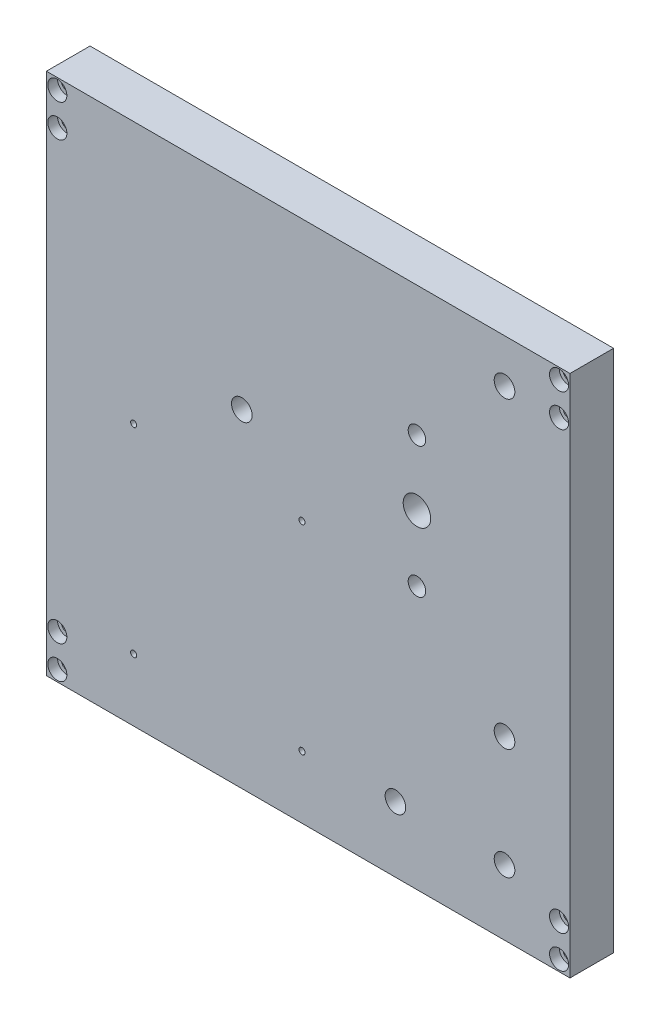
ISO-10303-21;
HEADER;
FILE_DESCRIPTION(('STEP AP214'),'2;1');
FILE_NAME('part.step','',(''),(''),'','','');
FILE_SCHEMA(('AUTOMOTIVE_DESIGN { 1 0 10303 214 1 1 1 1 }'));
ENDSEC;
DATA;
#1=APPLICATION_CONTEXT('core data for automotive mechanical design processes');
#2=APPLICATION_PROTOCOL_DEFINITION('international standard','automotive_design',2000,#1);
#3=PRODUCT_CONTEXT('',#1,'mechanical');
#4=PRODUCT('Part','Part','',(#3));
#5=PRODUCT_RELATED_PRODUCT_CATEGORY('part','',(#4));
#6=PRODUCT_DEFINITION_FORMATION('','',#4);
#7=PRODUCT_DEFINITION_CONTEXT('part definition',#1,'design');
#8=PRODUCT_DEFINITION('design','',#6,#7);
#9=PRODUCT_DEFINITION_SHAPE('','',#8);
#10=(LENGTH_UNIT() NAMED_UNIT(*) SI_UNIT(.MILLI.,.METRE.));
#11=(NAMED_UNIT(*) PLANE_ANGLE_UNIT() SI_UNIT($,.RADIAN.));
#12=(NAMED_UNIT(*) SI_UNIT($,.STERADIAN.) SOLID_ANGLE_UNIT());
#13=UNCERTAINTY_MEASURE_WITH_UNIT(LENGTH_MEASURE(1.E-05),#10,'distance_accuracy_value','');
#14=(GEOMETRIC_REPRESENTATION_CONTEXT(3) GLOBAL_UNCERTAINTY_ASSIGNED_CONTEXT((#13)) GLOBAL_UNIT_ASSIGNED_CONTEXT((#10,
#11,#12)) REPRESENTATION_CONTEXT('',''));
#15=CARTESIAN_POINT('',(0.,0.,0.));
#16=DIRECTION('',(0.,0.,1.));
#17=DIRECTION('',(1.,0.,0.));
#18=AXIS2_PLACEMENT_3D('',#15,#16,#17);
#19=CARTESIAN_POINT('',(-76.2,-76.2,12.7));
#20=DIRECTION('',(-1.,0.,0.));
#21=DIRECTION('',(0.,0.,1.));
#22=AXIS2_PLACEMENT_3D('',#19,#20,#21);
#23=PLANE('',#22);
#24=DIRECTION('',(0.,1.,0.));
#25=VECTOR('',#24,1.);
#26=CARTESIAN_POINT('',(-76.2,-76.2,0.));
#27=LINE('',#26,#25);
#28=CARTESIAN_POINT('',(-76.2,-76.2,0.));
#29=VERTEX_POINT('',#28);
#30=CARTESIAN_POINT('',(-76.2,76.2,0.));
#31=VERTEX_POINT('',#30);
#32=EDGE_CURVE('E114',#29,#31,#27,.T.);
#33=ORIENTED_EDGE('',*,*,#32,.F.);
#34=DIRECTION('',(0.,0.,-1.));
#35=VECTOR('',#34,1.);
#36=CARTESIAN_POINT('',(-76.2,-76.2,12.7));
#37=LINE('',#36,#35);
#38=CARTESIAN_POINT('',(-76.2,-76.2,12.7));
#39=VERTEX_POINT('',#38);
#40=EDGE_CURVE('E13',#39,#29,#37,.T.);
#41=ORIENTED_EDGE('',*,*,#40,.F.);
#42=DIRECTION('',(0.,1.,0.));
#43=VECTOR('',#42,1.);
#44=CARTESIAN_POINT('',(-76.2,-76.2,12.7));
#45=LINE('',#44,#43);
#46=CARTESIAN_POINT('',(-76.2,76.2,12.7));
#47=VERTEX_POINT('',#46);
#48=EDGE_CURVE('E108',#39,#47,#45,.T.);
#49=ORIENTED_EDGE('',*,*,#48,.T.);
#50=DIRECTION('',(0.,0.,-1.));
#51=VECTOR('',#50,1.);
#52=CARTESIAN_POINT('',(-76.2,76.2,12.7));
#53=LINE('',#52,#51);
#54=EDGE_CURVE('E51',#47,#31,#53,.T.);
#55=ORIENTED_EDGE('',*,*,#54,.T.);
#56=EDGE_LOOP('',(#33,#41,#49,#55));
#57=FACE_BOUND('',#56,.T.);
#58=ADVANCED_FACE('F48',(#57),#23,.T.);
#59=CARTESIAN_POINT('',(-76.2,-76.2,12.7));
#60=DIRECTION('',(0.,1.,0.));
#61=DIRECTION('',(0.,0.,1.));
#62=AXIS2_PLACEMENT_3D('',#59,#60,#61);
#63=PLANE('',#62);
#64=DIRECTION('',(1.,0.,0.));
#65=VECTOR('',#64,1.);
#66=CARTESIAN_POINT('',(-76.2,-76.2,0.));
#67=LINE('',#66,#65);
#68=CARTESIAN_POINT('',(76.2,-76.2,0.));
#69=VERTEX_POINT('',#68);
#70=EDGE_CURVE('E81',#29,#69,#67,.T.);
#71=ORIENTED_EDGE('',*,*,#70,.T.);
#72=DIRECTION('',(0.,0.,-1.));
#73=VECTOR('',#72,1.);
#74=CARTESIAN_POINT('',(76.2,-76.2,12.7));
#75=LINE('',#74,#73);
#76=CARTESIAN_POINT('',(76.2,-76.2,12.7));
#77=VERTEX_POINT('',#76);
#78=EDGE_CURVE('E57',#77,#69,#75,.T.);
#79=ORIENTED_EDGE('',*,*,#78,.F.);
#80=DIRECTION('',(1.,0.,0.));
#81=VECTOR('',#80,1.);
#82=CARTESIAN_POINT('',(-76.2,-76.2,12.7));
#83=LINE('',#82,#81);
#84=EDGE_CURVE('E98',#39,#77,#83,.T.);
#85=ORIENTED_EDGE('',*,*,#84,.F.);
#86=ORIENTED_EDGE('',*,*,#40,.T.);
#87=EDGE_LOOP('',(#71,#79,#85,#86));
#88=FACE_BOUND('',#87,.T.);
#89=ADVANCED_FACE('F125',(#88),#63,.F.);
#90=CARTESIAN_POINT('',(76.2,-76.2,12.7));
#91=DIRECTION('',(-1.,0.,0.));
#92=DIRECTION('',(0.,0.,1.));
#93=AXIS2_PLACEMENT_3D('',#90,#91,#92);
#94=PLANE('',#93);
#95=DIRECTION('',(0.,1.,0.));
#96=VECTOR('',#95,1.);
#97=CARTESIAN_POINT('',(76.2,-76.2,0.));
#98=LINE('',#97,#96);
#99=CARTESIAN_POINT('',(76.2,76.2,0.));
#100=VERTEX_POINT('',#99);
#101=EDGE_CURVE('E105',#69,#100,#98,.T.);
#102=ORIENTED_EDGE('',*,*,#101,.T.);
#103=DIRECTION('',(0.,0.,-1.));
#104=VECTOR('',#103,1.);
#105=CARTESIAN_POINT('',(76.2,76.2,12.7));
#106=LINE('',#105,#104);
#107=CARTESIAN_POINT('',(76.2,76.2,12.7));
#108=VERTEX_POINT('',#107);
#109=EDGE_CURVE('E102',#108,#100,#106,.T.);
#110=ORIENTED_EDGE('',*,*,#109,.F.);
#111=DIRECTION('',(0.,1.,0.));
#112=VECTOR('',#111,1.);
#113=CARTESIAN_POINT('',(76.2,-76.2,12.7));
#114=LINE('',#113,#112);
#115=EDGE_CURVE('E93',#77,#108,#114,.T.);
#116=ORIENTED_EDGE('',*,*,#115,.F.);
#117=ORIENTED_EDGE('',*,*,#78,.T.);
#118=EDGE_LOOP('',(#102,#110,#116,#117));
#119=FACE_BOUND('',#118,.T.);
#120=ADVANCED_FACE('F103',(#119),#94,.F.);
#121=CARTESIAN_POINT('',(-76.2,76.2,12.7));
#122=DIRECTION('',(0.,1.,0.));
#123=DIRECTION('',(0.,0.,1.));
#124=AXIS2_PLACEMENT_3D('',#121,#122,#123);
#125=PLANE('',#124);
#126=DIRECTION('',(1.,0.,0.));
#127=VECTOR('',#126,1.);
#128=CARTESIAN_POINT('',(-76.2,76.2,0.));
#129=LINE('',#128,#127);
#130=EDGE_CURVE('E117',#31,#100,#129,.T.);
#131=ORIENTED_EDGE('',*,*,#130,.F.);
#132=ORIENTED_EDGE('',*,*,#54,.F.);
#133=DIRECTION('',(1.,0.,0.));
#134=VECTOR('',#133,1.);
#135=CARTESIAN_POINT('',(-76.2,76.2,12.7));
#136=LINE('',#135,#134);
#137=EDGE_CURVE('E97',#47,#108,#136,.T.);
#138=ORIENTED_EDGE('',*,*,#137,.T.);
#139=ORIENTED_EDGE('',*,*,#109,.T.);
#140=EDGE_LOOP('',(#131,#132,#138,#139));
#141=FACE_BOUND('',#140,.T.);
#142=ADVANCED_FACE('F107',(#141),#125,.T.);
#143=CARTESIAN_POINT('',(0.,0.,12.7));
#144=DIRECTION('',(0.,0.,-1.));
#145=DIRECTION('',(-1.,0.,0.));
#146=AXIS2_PLACEMENT_3D('',#143,#144,#145);
#147=PLANE('',#146);
#148=CARTESIAN_POINT('',(31.6596969401435,0.299500000000012,12.7));
#149=DIRECTION('',(0.,0.,1.));
#150=DIRECTION('',(1.,0.,0.));
#151=AXIS2_PLACEMENT_3D('',#148,#149,#150);
#152=CIRCLE('',#151,2.5527);
#153=CARTESIAN_POINT('',(34.2123969401435,0.299500000000012,12.7));
#154=VERTEX_POINT('',#153);
#155=EDGE_CURVE('E298',#154,#154,#152,.T.);
#156=ORIENTED_EDGE('',*,*,#155,.F.);
#157=EDGE_LOOP('',(#156));
#158=FACE_BOUND('',#157,.T.);
#159=CARTESIAN_POINT('',(31.6596969401435,38.3995,12.7));
#160=DIRECTION('',(0.,0.,1.));
#161=DIRECTION('',(1.,0.,0.));
#162=AXIS2_PLACEMENT_3D('',#159,#160,#161);
#163=CIRCLE('',#162,2.5527);
#164=CARTESIAN_POINT('',(34.2123969401435,38.3995,12.7));
#165=VERTEX_POINT('',#164);
#166=EDGE_CURVE('E300',#165,#165,#163,.T.);
#167=ORIENTED_EDGE('',*,*,#166,.F.);
#168=EDGE_LOOP('',(#167));
#169=FACE_BOUND('',#168,.T.);
#170=CARTESIAN_POINT('',(31.6596969401435,19.3495,12.7));
#171=DIRECTION('',(0.,0.,1.));
#172=DIRECTION('',(1.,0.,0.));
#173=AXIS2_PLACEMENT_3D('',#170,#171,#172);
#174=CIRCLE('',#173,4.);
#175=CARTESIAN_POINT('',(35.6596969401435,19.3495,12.7));
#176=VERTEX_POINT('',#175);
#177=EDGE_CURVE('E308',#176,#176,#174,.T.);
#178=ORIENTED_EDGE('',*,*,#177,.F.);
#179=EDGE_LOOP('',(#178));
#180=FACE_BOUND('',#179,.T.);
#181=CARTESIAN_POINT('',(57.15,63.5,12.7));
#182=DIRECTION('',(0.,0.,1.));
#183=DIRECTION('',(1.,0.,0.));
#184=AXIS2_PLACEMENT_3D('',#181,#182,#183);
#185=CIRCLE('',#184,2.99999999999999);
#186=CARTESIAN_POINT('',(60.15,63.5,12.7));
#187=VERTEX_POINT('',#186);
#188=EDGE_CURVE('E314',#187,#187,#185,.T.);
#189=ORIENTED_EDGE('',*,*,#188,.F.);
#190=EDGE_LOOP('',(#189));
#191=FACE_BOUND('',#190,.T.);
#192=CARTESIAN_POINT('',(57.15,-24.801,12.7));
#193=DIRECTION('',(0.,0.,1.));
#194=DIRECTION('',(1.,0.,0.));
#195=AXIS2_PLACEMENT_3D('',#192,#193,#194);
#196=CIRCLE('',#195,2.99999999999999);
#197=CARTESIAN_POINT('',(60.15,-24.801,12.7));
#198=VERTEX_POINT('',#197);
#199=EDGE_CURVE('E320',#198,#198,#196,.T.);
#200=ORIENTED_EDGE('',*,*,#199,.F.);
#201=EDGE_LOOP('',(#200));
#202=FACE_BOUND('',#201,.T.);
#203=CARTESIAN_POINT('',(-19.3209091795697,19.3495,12.7));
#204=DIRECTION('',(0.,0.,1.));
#205=DIRECTION('',(1.,0.,0.));
#206=AXIS2_PLACEMENT_3D('',#203,#204,#205);
#207=CIRCLE('',#206,2.99999999999999);
#208=CARTESIAN_POINT('',(-16.3209091795697,19.3495,12.7));
#209=VERTEX_POINT('',#208);
#210=EDGE_CURVE('E326',#209,#209,#207,.T.);
#211=ORIENTED_EDGE('',*,*,#210,.F.);
#212=EDGE_LOOP('',(#211));
#213=FACE_BOUND('',#212,.T.);
#214=CARTESIAN_POINT('',(57.15,-57.15,12.7));
#215=DIRECTION('',(0.,0.,1.));
#216=DIRECTION('',(1.,0.,0.));
#217=AXIS2_PLACEMENT_3D('',#214,#215,#216);
#218=CIRCLE('',#217,2.99999999999999);
#219=CARTESIAN_POINT('',(60.15,-57.15,12.7));
#220=VERTEX_POINT('',#219);
#221=EDGE_CURVE('E332',#220,#220,#218,.T.);
#222=ORIENTED_EDGE('',*,*,#221,.F.);
#223=EDGE_LOOP('',(#222));
#224=FACE_BOUND('',#223,.T.);
#225=CARTESIAN_POINT('',(25.4,-57.15,12.7));
#226=DIRECTION('',(0.,0.,1.));
#227=DIRECTION('',(1.,0.,0.));
#228=AXIS2_PLACEMENT_3D('',#225,#226,#227);
#229=CIRCLE('',#228,2.99999999999999);
#230=CARTESIAN_POINT('',(28.4,-57.15,12.7));
#231=VERTEX_POINT('',#230);
#232=EDGE_CURVE('E338',#231,#231,#229,.T.);
#233=ORIENTED_EDGE('',*,*,#232,.F.);
#234=EDGE_LOOP('',(#233));
#235=FACE_BOUND('',#234,.T.);
#236=CARTESIAN_POINT('',(-73.025,63.5,12.7));
#237=DIRECTION('',(0.,0.,1.));
#238=DIRECTION('',(1.,0.,0.));
#239=AXIS2_PLACEMENT_3D('',#236,#237,#238);
#240=CIRCLE('',#239,2.77876000000001);
#241=CARTESIAN_POINT('',(-70.24624,63.5,12.7));
#242=VERTEX_POINT('',#241);
#243=EDGE_CURVE('E344',#242,#242,#240,.T.);
#244=ORIENTED_EDGE('',*,*,#243,.F.);
#245=EDGE_LOOP('',(#244));
#246=FACE_BOUND('',#245,.T.);
#247=CARTESIAN_POINT('',(-73.025,73.025,12.7));
#248=DIRECTION('',(0.,0.,1.));
#249=DIRECTION('',(1.,0.,0.));
#250=AXIS2_PLACEMENT_3D('',#247,#248,#249);
#251=CIRCLE('',#250,2.77876000000001);
#252=CARTESIAN_POINT('',(-70.24624,73.025,12.7));
#253=VERTEX_POINT('',#252);
#254=EDGE_CURVE('E356',#253,#253,#251,.T.);
#255=ORIENTED_EDGE('',*,*,#254,.F.);
#256=EDGE_LOOP('',(#255));
#257=FACE_BOUND('',#256,.T.);
#258=CARTESIAN_POINT('',(73.025,63.5,12.7));
#259=DIRECTION('',(0.,0.,1.));
#260=DIRECTION('',(1.,0.,0.));
#261=AXIS2_PLACEMENT_3D('',#258,#259,#260);
#262=CIRCLE('',#261,2.77876000000001);
#263=CARTESIAN_POINT('',(75.80376,63.5,12.7));
#264=VERTEX_POINT('',#263);
#265=EDGE_CURVE('E368',#264,#264,#262,.T.);
#266=ORIENTED_EDGE('',*,*,#265,.F.);
#267=EDGE_LOOP('',(#266));
#268=FACE_BOUND('',#267,.T.);
#269=CARTESIAN_POINT('',(73.025,73.025,12.7));
#270=DIRECTION('',(0.,0.,1.));
#271=DIRECTION('',(1.,0.,0.));
#272=AXIS2_PLACEMENT_3D('',#269,#270,#271);
#273=CIRCLE('',#272,2.77876000000001);
#274=CARTESIAN_POINT('',(75.80376,73.025,12.7));
#275=VERTEX_POINT('',#274);
#276=EDGE_CURVE('E380',#275,#275,#273,.T.);
#277=ORIENTED_EDGE('',*,*,#276,.F.);
#278=EDGE_LOOP('',(#277));
#279=FACE_BOUND('',#278,.T.);
#280=CARTESIAN_POINT('',(73.025,-63.5,12.7));
#281=DIRECTION('',(0.,0.,1.));
#282=DIRECTION('',(1.,0.,0.));
#283=AXIS2_PLACEMENT_3D('',#280,#281,#282);
#284=CIRCLE('',#283,2.77876000000001);
#285=CARTESIAN_POINT('',(75.80376,-63.5,12.7));
#286=VERTEX_POINT('',#285);
#287=EDGE_CURVE('E392',#286,#286,#284,.T.);
#288=ORIENTED_EDGE('',*,*,#287,.F.);
#289=EDGE_LOOP('',(#288));
#290=FACE_BOUND('',#289,.T.);
#291=CARTESIAN_POINT('',(73.025,-73.025,12.7));
#292=DIRECTION('',(0.,0.,1.));
#293=DIRECTION('',(1.,0.,0.));
#294=AXIS2_PLACEMENT_3D('',#291,#292,#293);
#295=CIRCLE('',#294,2.77876000000001);
#296=CARTESIAN_POINT('',(75.80376,-73.025,12.7));
#297=VERTEX_POINT('',#296);
#298=EDGE_CURVE('E404',#297,#297,#295,.T.);
#299=ORIENTED_EDGE('',*,*,#298,.F.);
#300=EDGE_LOOP('',(#299));
#301=FACE_BOUND('',#300,.T.);
#302=CARTESIAN_POINT('',(-73.025,-63.5,12.7));
#303=DIRECTION('',(0.,0.,1.));
#304=DIRECTION('',(1.,0.,0.));
#305=AXIS2_PLACEMENT_3D('',#302,#303,#304);
#306=CIRCLE('',#305,2.77876000000001);
#307=CARTESIAN_POINT('',(-70.24624,-63.5,12.7));
#308=VERTEX_POINT('',#307);
#309=EDGE_CURVE('E416',#308,#308,#306,.T.);
#310=ORIENTED_EDGE('',*,*,#309,.F.);
#311=EDGE_LOOP('',(#310));
#312=FACE_BOUND('',#311,.T.);
#313=CARTESIAN_POINT('',(-73.025,-73.025,12.7));
#314=DIRECTION('',(0.,0.,1.));
#315=DIRECTION('',(1.,0.,0.));
#316=AXIS2_PLACEMENT_3D('',#313,#314,#315);
#317=CIRCLE('',#316,2.77876000000001);
#318=CARTESIAN_POINT('',(-70.24624,-73.025,12.7));
#319=VERTEX_POINT('',#318);
#320=EDGE_CURVE('E428',#319,#319,#317,.T.);
#321=ORIENTED_EDGE('',*,*,#320,.F.);
#322=EDGE_LOOP('',(#321));
#323=FACE_BOUND('',#322,.T.);
#324=CARTESIAN_POINT('',(-50.8,0.,12.7));
#325=DIRECTION('',(0.,0.,1.));
#326=DIRECTION('',(1.,0.,0.));
#327=AXIS2_PLACEMENT_3D('',#324,#325,#326);
#328=CIRCLE('',#327,0.888999999999987);
#329=CARTESIAN_POINT('',(-49.911,0.,12.7));
#330=VERTEX_POINT('',#329);
#331=EDGE_CURVE('E440',#330,#330,#328,.T.);
#332=ORIENTED_EDGE('',*,*,#331,.F.);
#333=EDGE_LOOP('',(#332));
#334=FACE_BOUND('',#333,.T.);
#335=CARTESIAN_POINT('',(-50.8,-58.,12.7));
#336=DIRECTION('',(0.,0.,1.));
#337=DIRECTION('',(1.,0.,0.));
#338=AXIS2_PLACEMENT_3D('',#335,#336,#337);
#339=CIRCLE('',#338,0.888999999999987);
#340=CARTESIAN_POINT('',(-49.911,-58.,12.7));
#341=VERTEX_POINT('',#340);
#342=EDGE_CURVE('E446',#341,#341,#339,.T.);
#343=ORIENTED_EDGE('',*,*,#342,.F.);
#344=EDGE_LOOP('',(#343));
#345=FACE_BOUND('',#344,.T.);
#346=CARTESIAN_POINT('',(-1.79999999999998,-58.,12.7));
#347=DIRECTION('',(0.,0.,1.));
#348=DIRECTION('',(1.,0.,0.));
#349=AXIS2_PLACEMENT_3D('',#346,#347,#348);
#350=CIRCLE('',#349,0.888999999999987);
#351=CARTESIAN_POINT('',(-0.910999999999988,-58.,12.7));
#352=VERTEX_POINT('',#351);
#353=EDGE_CURVE('E452',#352,#352,#350,.T.);
#354=ORIENTED_EDGE('',*,*,#353,.F.);
#355=EDGE_LOOP('',(#354));
#356=FACE_BOUND('',#355,.T.);
#357=CARTESIAN_POINT('',(-1.79999999999996,0.,12.7));
#358=DIRECTION('',(0.,0.,1.));
#359=DIRECTION('',(1.,0.,0.));
#360=AXIS2_PLACEMENT_3D('',#357,#358,#359);
#361=CIRCLE('',#360,0.888999999999987);
#362=CARTESIAN_POINT('',(-0.910999999999974,0.,12.7));
#363=VERTEX_POINT('',#362);
#364=EDGE_CURVE('E458',#363,#363,#361,.T.);
#365=ORIENTED_EDGE('',*,*,#364,.F.);
#366=EDGE_LOOP('',(#365));
#367=FACE_BOUND('',#366,.T.);
#368=ORIENTED_EDGE('',*,*,#48,.F.);
#369=ORIENTED_EDGE('',*,*,#84,.T.);
#370=ORIENTED_EDGE('',*,*,#115,.T.);
#371=ORIENTED_EDGE('',*,*,#137,.F.);
#372=EDGE_LOOP('',(#368,#369,#370,#371));
#373=FACE_BOUND('',#372,.T.);
#374=ADVANCED_FACE('F96',(#158,#169,#180,#191,#202,#213,#224,#235,#246,#257,#268,#279,#290,#301,
#312,#323,#334,#345,#356,#367,#373),#147,.F.);
#375=CARTESIAN_POINT('',(0.,0.,0.));
#376=DIRECTION('',(0.,0.,-1.));
#377=DIRECTION('',(-1.,0.,0.));
#378=AXIS2_PLACEMENT_3D('',#375,#376,#377);
#379=PLANE('',#378);
#380=CARTESIAN_POINT('',(31.6596969401435,0.299500000000012,0.));
#381=DIRECTION('',(0.,0.,1.));
#382=DIRECTION('',(1.,0.,0.));
#383=AXIS2_PLACEMENT_3D('',#380,#381,#382);
#384=CIRCLE('',#383,2.5527);
#385=CARTESIAN_POINT('',(34.2123969401435,0.299500000000012,0.));
#386=VERTEX_POINT('',#385);
#387=EDGE_CURVE('E296',#386,#386,#384,.T.);
#388=ORIENTED_EDGE('',*,*,#387,.T.);
#389=EDGE_LOOP('',(#388));
#390=FACE_BOUND('',#389,.T.);
#391=CARTESIAN_POINT('',(31.6596969401435,38.3995,0.));
#392=DIRECTION('',(0.,0.,1.));
#393=DIRECTION('',(1.,0.,0.));
#394=AXIS2_PLACEMENT_3D('',#391,#392,#393);
#395=CIRCLE('',#394,2.5527);
#396=CARTESIAN_POINT('',(34.2123969401435,38.3995,0.));
#397=VERTEX_POINT('',#396);
#398=EDGE_CURVE('E305',#397,#397,#395,.T.);
#399=ORIENTED_EDGE('',*,*,#398,.T.);
#400=EDGE_LOOP('',(#399));
#401=FACE_BOUND('',#400,.T.);
#402=CARTESIAN_POINT('',(31.6596969401435,19.3495,0.));
#403=DIRECTION('',(0.,0.,1.));
#404=DIRECTION('',(1.,0.,0.));
#405=AXIS2_PLACEMENT_3D('',#402,#403,#404);
#406=CIRCLE('',#405,4.);
#407=CARTESIAN_POINT('',(35.6596969401435,19.3495,0.));
#408=VERTEX_POINT('',#407);
#409=EDGE_CURVE('E311',#408,#408,#406,.T.);
#410=ORIENTED_EDGE('',*,*,#409,.T.);
#411=EDGE_LOOP('',(#410));
#412=FACE_BOUND('',#411,.T.);
#413=CARTESIAN_POINT('',(57.15,63.5,0.));
#414=DIRECTION('',(0.,0.,1.));
#415=DIRECTION('',(1.,0.,0.));
#416=AXIS2_PLACEMENT_3D('',#413,#414,#415);
#417=CIRCLE('',#416,3.);
#418=CARTESIAN_POINT('',(60.15,63.5,0.));
#419=VERTEX_POINT('',#418);
#420=EDGE_CURVE('E317',#419,#419,#417,.T.);
#421=ORIENTED_EDGE('',*,*,#420,.T.);
#422=EDGE_LOOP('',(#421));
#423=FACE_BOUND('',#422,.T.);
#424=CARTESIAN_POINT('',(57.15,-24.801,0.));
#425=DIRECTION('',(0.,0.,1.));
#426=DIRECTION('',(1.,0.,0.));
#427=AXIS2_PLACEMENT_3D('',#424,#425,#426);
#428=CIRCLE('',#427,3.);
#429=CARTESIAN_POINT('',(60.15,-24.801,0.));
#430=VERTEX_POINT('',#429);
#431=EDGE_CURVE('E323',#430,#430,#428,.T.);
#432=ORIENTED_EDGE('',*,*,#431,.T.);
#433=EDGE_LOOP('',(#432));
#434=FACE_BOUND('',#433,.T.);
#435=CARTESIAN_POINT('',(-19.3209091795697,19.3495,0.));
#436=DIRECTION('',(0.,0.,1.));
#437=DIRECTION('',(1.,0.,0.));
#438=AXIS2_PLACEMENT_3D('',#435,#436,#437);
#439=CIRCLE('',#438,3.);
#440=CARTESIAN_POINT('',(-16.3209091795697,19.3495,0.));
#441=VERTEX_POINT('',#440);
#442=EDGE_CURVE('E329',#441,#441,#439,.T.);
#443=ORIENTED_EDGE('',*,*,#442,.T.);
#444=EDGE_LOOP('',(#443));
#445=FACE_BOUND('',#444,.T.);
#446=CARTESIAN_POINT('',(57.15,-57.15,0.));
#447=DIRECTION('',(0.,0.,1.));
#448=DIRECTION('',(1.,0.,0.));
#449=AXIS2_PLACEMENT_3D('',#446,#447,#448);
#450=CIRCLE('',#449,3.);
#451=CARTESIAN_POINT('',(60.15,-57.15,0.));
#452=VERTEX_POINT('',#451);
#453=EDGE_CURVE('E335',#452,#452,#450,.T.);
#454=ORIENTED_EDGE('',*,*,#453,.T.);
#455=EDGE_LOOP('',(#454));
#456=FACE_BOUND('',#455,.T.);
#457=CARTESIAN_POINT('',(25.4,-57.15,0.));
#458=DIRECTION('',(0.,0.,1.));
#459=DIRECTION('',(1.,0.,0.));
#460=AXIS2_PLACEMENT_3D('',#457,#458,#459);
#461=CIRCLE('',#460,3.);
#462=CARTESIAN_POINT('',(28.4,-57.15,0.));
#463=VERTEX_POINT('',#462);
#464=EDGE_CURVE('E341',#463,#463,#461,.T.);
#465=ORIENTED_EDGE('',*,*,#464,.T.);
#466=EDGE_LOOP('',(#465));
#467=FACE_BOUND('',#466,.T.);
#468=CARTESIAN_POINT('',(-73.025,63.5,0.));
#469=DIRECTION('',(0.,0.,1.));
#470=DIRECTION('',(1.,0.,0.));
#471=AXIS2_PLACEMENT_3D('',#468,#469,#470);
#472=CIRCLE('',#471,1.63194999999999);
#473=CARTESIAN_POINT('',(-71.39305,63.5,0.));
#474=VERTEX_POINT('',#473);
#475=EDGE_CURVE('E353',#474,#474,#472,.T.);
#476=ORIENTED_EDGE('',*,*,#475,.T.);
#477=EDGE_LOOP('',(#476));
#478=FACE_BOUND('',#477,.T.);
#479=CARTESIAN_POINT('',(-73.025,73.025,0.));
#480=DIRECTION('',(0.,0.,1.));
#481=DIRECTION('',(1.,0.,0.));
#482=AXIS2_PLACEMENT_3D('',#479,#480,#481);
#483=CIRCLE('',#482,1.63194999999999);
#484=CARTESIAN_POINT('',(-71.39305,73.025,0.));
#485=VERTEX_POINT('',#484);
#486=EDGE_CURVE('E365',#485,#485,#483,.T.);
#487=ORIENTED_EDGE('',*,*,#486,.T.);
#488=EDGE_LOOP('',(#487));
#489=FACE_BOUND('',#488,.T.);
#490=CARTESIAN_POINT('',(73.025,63.5,0.));
#491=DIRECTION('',(0.,0.,1.));
#492=DIRECTION('',(1.,0.,0.));
#493=AXIS2_PLACEMENT_3D('',#490,#491,#492);
#494=CIRCLE('',#493,1.63194999999999);
#495=CARTESIAN_POINT('',(74.65695,63.5,0.));
#496=VERTEX_POINT('',#495);
#497=EDGE_CURVE('E377',#496,#496,#494,.T.);
#498=ORIENTED_EDGE('',*,*,#497,.T.);
#499=EDGE_LOOP('',(#498));
#500=FACE_BOUND('',#499,.T.);
#501=CARTESIAN_POINT('',(73.025,73.025,0.));
#502=DIRECTION('',(0.,0.,1.));
#503=DIRECTION('',(1.,0.,0.));
#504=AXIS2_PLACEMENT_3D('',#501,#502,#503);
#505=CIRCLE('',#504,1.63194999999999);
#506=CARTESIAN_POINT('',(74.65695,73.025,0.));
#507=VERTEX_POINT('',#506);
#508=EDGE_CURVE('E389',#507,#507,#505,.T.);
#509=ORIENTED_EDGE('',*,*,#508,.T.);
#510=EDGE_LOOP('',(#509));
#511=FACE_BOUND('',#510,.T.);
#512=CARTESIAN_POINT('',(73.025,-63.5,0.));
#513=DIRECTION('',(0.,0.,1.));
#514=DIRECTION('',(1.,0.,0.));
#515=AXIS2_PLACEMENT_3D('',#512,#513,#514);
#516=CIRCLE('',#515,1.63194999999999);
#517=CARTESIAN_POINT('',(74.65695,-63.5,0.));
#518=VERTEX_POINT('',#517);
#519=EDGE_CURVE('E401',#518,#518,#516,.T.);
#520=ORIENTED_EDGE('',*,*,#519,.T.);
#521=EDGE_LOOP('',(#520));
#522=FACE_BOUND('',#521,.T.);
#523=CARTESIAN_POINT('',(73.025,-73.025,0.));
#524=DIRECTION('',(0.,0.,1.));
#525=DIRECTION('',(1.,0.,0.));
#526=AXIS2_PLACEMENT_3D('',#523,#524,#525);
#527=CIRCLE('',#526,1.63194999999999);
#528=CARTESIAN_POINT('',(74.65695,-73.025,0.));
#529=VERTEX_POINT('',#528);
#530=EDGE_CURVE('E413',#529,#529,#527,.T.);
#531=ORIENTED_EDGE('',*,*,#530,.T.);
#532=EDGE_LOOP('',(#531));
#533=FACE_BOUND('',#532,.T.);
#534=CARTESIAN_POINT('',(-73.025,-63.5,0.));
#535=DIRECTION('',(0.,0.,1.));
#536=DIRECTION('',(1.,0.,0.));
#537=AXIS2_PLACEMENT_3D('',#534,#535,#536);
#538=CIRCLE('',#537,1.63194999999999);
#539=CARTESIAN_POINT('',(-71.39305,-63.5,0.));
#540=VERTEX_POINT('',#539);
#541=EDGE_CURVE('E425',#540,#540,#538,.T.);
#542=ORIENTED_EDGE('',*,*,#541,.T.);
#543=EDGE_LOOP('',(#542));
#544=FACE_BOUND('',#543,.T.);
#545=CARTESIAN_POINT('',(-73.025,-73.025,0.));
#546=DIRECTION('',(0.,0.,1.));
#547=DIRECTION('',(1.,0.,0.));
#548=AXIS2_PLACEMENT_3D('',#545,#546,#547);
#549=CIRCLE('',#548,1.63194999999999);
#550=CARTESIAN_POINT('',(-71.39305,-73.025,0.));
#551=VERTEX_POINT('',#550);
#552=EDGE_CURVE('E437',#551,#551,#549,.T.);
#553=ORIENTED_EDGE('',*,*,#552,.T.);
#554=EDGE_LOOP('',(#553));
#555=FACE_BOUND('',#554,.T.);
#556=CARTESIAN_POINT('',(-50.8,0.,0.));
#557=DIRECTION('',(0.,0.,1.));
#558=DIRECTION('',(1.,0.,0.));
#559=AXIS2_PLACEMENT_3D('',#556,#557,#558);
#560=CIRCLE('',#559,0.889000000000001);
#561=CARTESIAN_POINT('',(-49.911,0.,0.));
#562=VERTEX_POINT('',#561);
#563=EDGE_CURVE('E443',#562,#562,#560,.T.);
#564=ORIENTED_EDGE('',*,*,#563,.T.);
#565=EDGE_LOOP('',(#564));
#566=FACE_BOUND('',#565,.T.);
#567=CARTESIAN_POINT('',(-50.8,-58.,0.));
#568=DIRECTION('',(0.,0.,1.));
#569=DIRECTION('',(1.,0.,0.));
#570=AXIS2_PLACEMENT_3D('',#567,#568,#569);
#571=CIRCLE('',#570,0.889000000000001);
#572=CARTESIAN_POINT('',(-49.911,-58.,0.));
#573=VERTEX_POINT('',#572);
#574=EDGE_CURVE('E449',#573,#573,#571,.T.);
#575=ORIENTED_EDGE('',*,*,#574,.T.);
#576=EDGE_LOOP('',(#575));
#577=FACE_BOUND('',#576,.T.);
#578=CARTESIAN_POINT('',(-1.79999999999998,-58.,0.));
#579=DIRECTION('',(0.,0.,1.));
#580=DIRECTION('',(1.,0.,0.));
#581=AXIS2_PLACEMENT_3D('',#578,#579,#580);
#582=CIRCLE('',#581,0.888999999999998);
#583=CARTESIAN_POINT('',(-0.910999999999978,-58.,0.));
#584=VERTEX_POINT('',#583);
#585=EDGE_CURVE('E455',#584,#584,#582,.T.);
#586=ORIENTED_EDGE('',*,*,#585,.T.);
#587=EDGE_LOOP('',(#586));
#588=FACE_BOUND('',#587,.T.);
#589=CARTESIAN_POINT('',(-1.79999999999996,0.,0.));
#590=DIRECTION('',(0.,0.,1.));
#591=DIRECTION('',(1.,0.,0.));
#592=AXIS2_PLACEMENT_3D('',#589,#590,#591);
#593=CIRCLE('',#592,0.888999999999998);
#594=CARTESIAN_POINT('',(-0.910999999999964,0.,0.));
#595=VERTEX_POINT('',#594);
#596=EDGE_CURVE('E118',#595,#595,#593,.T.);
#597=ORIENTED_EDGE('',*,*,#596,.T.);
#598=EDGE_LOOP('',(#597));
#599=FACE_BOUND('',#598,.T.);
#600=ORIENTED_EDGE('',*,*,#32,.T.);
#601=ORIENTED_EDGE('',*,*,#130,.T.);
#602=ORIENTED_EDGE('',*,*,#101,.F.);
#603=ORIENTED_EDGE('',*,*,#70,.F.);
#604=EDGE_LOOP('',(#600,#601,#602,#603));
#605=FACE_BOUND('',#604,.T.);
#606=ADVANCED_FACE('F123',(#390,#401,#412,#423,#434,#445,#456,#467,#478,#489,#500,#511,#522,
#533,#544,#555,#566,#577,#588,#599,#605),#379,.T.);
#607=CARTESIAN_POINT('',(-1.79999999999996,0.,12.7));
#608=DIRECTION('',(0.,0.,1.));
#609=DIRECTION('',(1.,0.,0.));
#610=AXIS2_PLACEMENT_3D('',#607,#608,#609);
#611=CYLINDRICAL_SURFACE('',#610,0.888999999999992);
#612=ORIENTED_EDGE('',*,*,#596,.F.);
#613=EDGE_LOOP('',(#612));
#614=FACE_BOUND('',#613,.T.);
#615=ORIENTED_EDGE('',*,*,#364,.T.);
#616=EDGE_LOOP('',(#615));
#617=FACE_BOUND('',#616,.T.);
#618=ADVANCED_FACE('F144',(#614,#617),#611,.F.);
#619=CARTESIAN_POINT('',(-1.79999999999998,-58.,12.7));
#620=DIRECTION('',(0.,0.,1.));
#621=DIRECTION('',(1.,0.,0.));
#622=AXIS2_PLACEMENT_3D('',#619,#620,#621);
#623=CYLINDRICAL_SURFACE('',#622,0.888999999999992);
#624=ORIENTED_EDGE('',*,*,#585,.F.);
#625=EDGE_LOOP('',(#624));
#626=FACE_BOUND('',#625,.T.);
#627=ORIENTED_EDGE('',*,*,#353,.T.);
#628=EDGE_LOOP('',(#627));
#629=FACE_BOUND('',#628,.T.);
#630=ADVANCED_FACE('F151',(#626,#629),#623,.F.);
#631=CARTESIAN_POINT('',(-50.8,-58.,12.7));
#632=DIRECTION('',(0.,0.,1.));
#633=DIRECTION('',(1.,0.,0.));
#634=AXIS2_PLACEMENT_3D('',#631,#632,#633);
#635=CYLINDRICAL_SURFACE('',#634,0.888999999999994);
#636=ORIENTED_EDGE('',*,*,#574,.F.);
#637=EDGE_LOOP('',(#636));
#638=FACE_BOUND('',#637,.T.);
#639=ORIENTED_EDGE('',*,*,#342,.T.);
#640=EDGE_LOOP('',(#639));
#641=FACE_BOUND('',#640,.T.);
#642=ADVANCED_FACE('F155',(#638,#641),#635,.F.);
#643=CARTESIAN_POINT('',(-50.8,0.,12.7));
#644=DIRECTION('',(0.,0.,1.));
#645=DIRECTION('',(1.,0.,0.));
#646=AXIS2_PLACEMENT_3D('',#643,#644,#645);
#647=CYLINDRICAL_SURFACE('',#646,0.888999999999994);
#648=ORIENTED_EDGE('',*,*,#563,.F.);
#649=EDGE_LOOP('',(#648));
#650=FACE_BOUND('',#649,.T.);
#651=ORIENTED_EDGE('',*,*,#331,.T.);
#652=EDGE_LOOP('',(#651));
#653=FACE_BOUND('',#652,.T.);
#654=ADVANCED_FACE('F159',(#650,#653),#647,.F.);
#655=CARTESIAN_POINT('',(-73.025,-73.025,12.7));
#656=DIRECTION('',(0.,0.,1.));
#657=DIRECTION('',(1.,0.,0.));
#658=AXIS2_PLACEMENT_3D('',#655,#656,#657);
#659=CYLINDRICAL_SURFACE('',#658,1.63194999999999);
#660=ORIENTED_EDGE('',*,*,#552,.F.);
#661=EDGE_LOOP('',(#660));
#662=FACE_BOUND('',#661,.T.);
#663=CARTESIAN_POINT('',(-73.025,-73.025,9.8552));
#664=DIRECTION('',(0.,0.,1.));
#665=DIRECTION('',(1.,0.,0.));
#666=AXIS2_PLACEMENT_3D('',#663,#664,#665);
#667=CIRCLE('',#666,1.63194999999999);
#668=CARTESIAN_POINT('',(-71.39305,-73.025,9.8552));
#669=VERTEX_POINT('',#668);
#670=EDGE_CURVE('E434',#669,#669,#667,.T.);
#671=ORIENTED_EDGE('',*,*,#670,.T.);
#672=EDGE_LOOP('',(#671));
#673=FACE_BOUND('',#672,.T.);
#674=ADVANCED_FACE('F163',(#662,#673),#659,.F.);
#675=CARTESIAN_POINT('',(-71.39305,-73.025,9.8552));
#676=DIRECTION('',(0.,0.,-1.));
#677=DIRECTION('',(-1.,0.,0.));
#678=AXIS2_PLACEMENT_3D('',#675,#676,#677);
#679=PLANE('',#678);
#680=ORIENTED_EDGE('',*,*,#670,.F.);
#681=EDGE_LOOP('',(#680));
#682=FACE_BOUND('',#681,.T.);
#683=CARTESIAN_POINT('',(-73.025,-73.025,9.8552));
#684=DIRECTION('',(0.,0.,1.));
#685=DIRECTION('',(1.,0.,0.));
#686=AXIS2_PLACEMENT_3D('',#683,#684,#685);
#687=CIRCLE('',#686,2.77876000000001);
#688=CARTESIAN_POINT('',(-70.24624,-73.025,9.8552));
#689=VERTEX_POINT('',#688);
#690=EDGE_CURVE('E431',#689,#689,#687,.T.);
#691=ORIENTED_EDGE('',*,*,#690,.T.);
#692=EDGE_LOOP('',(#691));
#693=FACE_BOUND('',#692,.T.);
#694=ADVANCED_FACE('F167',(#682,#693),#679,.F.);
#695=CARTESIAN_POINT('',(-73.025,-73.025,12.7));
#696=DIRECTION('',(0.,0.,1.));
#697=DIRECTION('',(1.,0.,0.));
#698=AXIS2_PLACEMENT_3D('',#695,#696,#697);
#699=CYLINDRICAL_SURFACE('',#698,2.77876000000001);
#700=ORIENTED_EDGE('',*,*,#690,.F.);
#701=EDGE_LOOP('',(#700));
#702=FACE_BOUND('',#701,.T.);
#703=ORIENTED_EDGE('',*,*,#320,.T.);
#704=EDGE_LOOP('',(#703));
#705=FACE_BOUND('',#704,.T.);
#706=ADVANCED_FACE('F171',(#702,#705),#699,.F.);
#707=CARTESIAN_POINT('',(-73.025,-63.5,12.7));
#708=DIRECTION('',(0.,0.,1.));
#709=DIRECTION('',(1.,0.,0.));
#710=AXIS2_PLACEMENT_3D('',#707,#708,#709);
#711=CYLINDRICAL_SURFACE('',#710,1.63194999999999);
#712=ORIENTED_EDGE('',*,*,#541,.F.);
#713=EDGE_LOOP('',(#712));
#714=FACE_BOUND('',#713,.T.);
#715=CARTESIAN_POINT('',(-73.025,-63.5,9.8552));
#716=DIRECTION('',(0.,0.,1.));
#717=DIRECTION('',(1.,0.,0.));
#718=AXIS2_PLACEMENT_3D('',#715,#716,#717);
#719=CIRCLE('',#718,1.63194999999999);
#720=CARTESIAN_POINT('',(-71.39305,-63.5,9.8552));
#721=VERTEX_POINT('',#720);
#722=EDGE_CURVE('E422',#721,#721,#719,.T.);
#723=ORIENTED_EDGE('',*,*,#722,.T.);
#724=EDGE_LOOP('',(#723));
#725=FACE_BOUND('',#724,.T.);
#726=ADVANCED_FACE('F175',(#714,#725),#711,.F.);
#727=CARTESIAN_POINT('',(-71.39305,-63.5,9.8552));
#728=DIRECTION('',(0.,0.,-1.));
#729=DIRECTION('',(-1.,0.,0.));
#730=AXIS2_PLACEMENT_3D('',#727,#728,#729);
#731=PLANE('',#730);
#732=ORIENTED_EDGE('',*,*,#722,.F.);
#733=EDGE_LOOP('',(#732));
#734=FACE_BOUND('',#733,.T.);
#735=CARTESIAN_POINT('',(-73.025,-63.5,9.8552));
#736=DIRECTION('',(0.,0.,1.));
#737=DIRECTION('',(1.,0.,0.));
#738=AXIS2_PLACEMENT_3D('',#735,#736,#737);
#739=CIRCLE('',#738,2.77876000000001);
#740=CARTESIAN_POINT('',(-70.24624,-63.5,9.8552));
#741=VERTEX_POINT('',#740);
#742=EDGE_CURVE('E419',#741,#741,#739,.T.);
#743=ORIENTED_EDGE('',*,*,#742,.T.);
#744=EDGE_LOOP('',(#743));
#745=FACE_BOUND('',#744,.T.);
#746=ADVANCED_FACE('F179',(#734,#745),#731,.F.);
#747=CARTESIAN_POINT('',(-73.025,-63.5,12.7));
#748=DIRECTION('',(0.,0.,1.));
#749=DIRECTION('',(1.,0.,0.));
#750=AXIS2_PLACEMENT_3D('',#747,#748,#749);
#751=CYLINDRICAL_SURFACE('',#750,2.77876000000001);
#752=ORIENTED_EDGE('',*,*,#742,.F.);
#753=EDGE_LOOP('',(#752));
#754=FACE_BOUND('',#753,.T.);
#755=ORIENTED_EDGE('',*,*,#309,.T.);
#756=EDGE_LOOP('',(#755));
#757=FACE_BOUND('',#756,.T.);
#758=ADVANCED_FACE('F183',(#754,#757),#751,.F.);
#759=CARTESIAN_POINT('',(73.025,-73.025,12.7));
#760=DIRECTION('',(0.,0.,1.));
#761=DIRECTION('',(1.,0.,0.));
#762=AXIS2_PLACEMENT_3D('',#759,#760,#761);
#763=CYLINDRICAL_SURFACE('',#762,1.63194999999999);
#764=ORIENTED_EDGE('',*,*,#530,.F.);
#765=EDGE_LOOP('',(#764));
#766=FACE_BOUND('',#765,.T.);
#767=CARTESIAN_POINT('',(73.025,-73.025,9.8552));
#768=DIRECTION('',(0.,0.,1.));
#769=DIRECTION('',(1.,0.,0.));
#770=AXIS2_PLACEMENT_3D('',#767,#768,#769);
#771=CIRCLE('',#770,1.63194999999999);
#772=CARTESIAN_POINT('',(74.65695,-73.025,9.8552));
#773=VERTEX_POINT('',#772);
#774=EDGE_CURVE('E410',#773,#773,#771,.T.);
#775=ORIENTED_EDGE('',*,*,#774,.T.);
#776=EDGE_LOOP('',(#775));
#777=FACE_BOUND('',#776,.T.);
#778=ADVANCED_FACE('F187',(#766,#777),#763,.F.);
#779=CARTESIAN_POINT('',(74.65695,-73.025,9.8552));
#780=DIRECTION('',(0.,0.,-1.));
#781=DIRECTION('',(-1.,0.,0.));
#782=AXIS2_PLACEMENT_3D('',#779,#780,#781);
#783=PLANE('',#782);
#784=ORIENTED_EDGE('',*,*,#774,.F.);
#785=EDGE_LOOP('',(#784));
#786=FACE_BOUND('',#785,.T.);
#787=CARTESIAN_POINT('',(73.025,-73.025,9.8552));
#788=DIRECTION('',(0.,0.,1.));
#789=DIRECTION('',(1.,0.,0.));
#790=AXIS2_PLACEMENT_3D('',#787,#788,#789);
#791=CIRCLE('',#790,2.77876000000001);
#792=CARTESIAN_POINT('',(75.80376,-73.025,9.8552));
#793=VERTEX_POINT('',#792);
#794=EDGE_CURVE('E407',#793,#793,#791,.T.);
#795=ORIENTED_EDGE('',*,*,#794,.T.);
#796=EDGE_LOOP('',(#795));
#797=FACE_BOUND('',#796,.T.);
#798=ADVANCED_FACE('F191',(#786,#797),#783,.F.);
#799=CARTESIAN_POINT('',(73.025,-73.025,12.7));
#800=DIRECTION('',(0.,0.,1.));
#801=DIRECTION('',(1.,0.,0.));
#802=AXIS2_PLACEMENT_3D('',#799,#800,#801);
#803=CYLINDRICAL_SURFACE('',#802,2.77876000000001);
#804=ORIENTED_EDGE('',*,*,#794,.F.);
#805=EDGE_LOOP('',(#804));
#806=FACE_BOUND('',#805,.T.);
#807=ORIENTED_EDGE('',*,*,#298,.T.);
#808=EDGE_LOOP('',(#807));
#809=FACE_BOUND('',#808,.T.);
#810=ADVANCED_FACE('F195',(#806,#809),#803,.F.);
#811=CARTESIAN_POINT('',(73.025,-63.5,12.7));
#812=DIRECTION('',(0.,0.,1.));
#813=DIRECTION('',(1.,0.,0.));
#814=AXIS2_PLACEMENT_3D('',#811,#812,#813);
#815=CYLINDRICAL_SURFACE('',#814,1.63194999999999);
#816=ORIENTED_EDGE('',*,*,#519,.F.);
#817=EDGE_LOOP('',(#816));
#818=FACE_BOUND('',#817,.T.);
#819=CARTESIAN_POINT('',(73.025,-63.5,9.8552));
#820=DIRECTION('',(0.,0.,1.));
#821=DIRECTION('',(1.,0.,0.));
#822=AXIS2_PLACEMENT_3D('',#819,#820,#821);
#823=CIRCLE('',#822,1.63194999999999);
#824=CARTESIAN_POINT('',(74.65695,-63.5,9.8552));
#825=VERTEX_POINT('',#824);
#826=EDGE_CURVE('E398',#825,#825,#823,.T.);
#827=ORIENTED_EDGE('',*,*,#826,.T.);
#828=EDGE_LOOP('',(#827));
#829=FACE_BOUND('',#828,.T.);
#830=ADVANCED_FACE('F199',(#818,#829),#815,.F.);
#831=CARTESIAN_POINT('',(74.65695,-63.5,9.8552));
#832=DIRECTION('',(0.,0.,-1.));
#833=DIRECTION('',(-1.,0.,0.));
#834=AXIS2_PLACEMENT_3D('',#831,#832,#833);
#835=PLANE('',#834);
#836=ORIENTED_EDGE('',*,*,#826,.F.);
#837=EDGE_LOOP('',(#836));
#838=FACE_BOUND('',#837,.T.);
#839=CARTESIAN_POINT('',(73.025,-63.5,9.8552));
#840=DIRECTION('',(0.,0.,1.));
#841=DIRECTION('',(1.,0.,0.));
#842=AXIS2_PLACEMENT_3D('',#839,#840,#841);
#843=CIRCLE('',#842,2.77876000000001);
#844=CARTESIAN_POINT('',(75.80376,-63.5,9.8552));
#845=VERTEX_POINT('',#844);
#846=EDGE_CURVE('E395',#845,#845,#843,.T.);
#847=ORIENTED_EDGE('',*,*,#846,.T.);
#848=EDGE_LOOP('',(#847));
#849=FACE_BOUND('',#848,.T.);
#850=ADVANCED_FACE('F203',(#838,#849),#835,.F.);
#851=CARTESIAN_POINT('',(73.025,-63.5,12.7));
#852=DIRECTION('',(0.,0.,1.));
#853=DIRECTION('',(1.,0.,0.));
#854=AXIS2_PLACEMENT_3D('',#851,#852,#853);
#855=CYLINDRICAL_SURFACE('',#854,2.77876000000001);
#856=ORIENTED_EDGE('',*,*,#846,.F.);
#857=EDGE_LOOP('',(#856));
#858=FACE_BOUND('',#857,.T.);
#859=ORIENTED_EDGE('',*,*,#287,.T.);
#860=EDGE_LOOP('',(#859));
#861=FACE_BOUND('',#860,.T.);
#862=ADVANCED_FACE('F207',(#858,#861),#855,.F.);
#863=CARTESIAN_POINT('',(73.025,73.025,12.7));
#864=DIRECTION('',(0.,0.,1.));
#865=DIRECTION('',(1.,0.,0.));
#866=AXIS2_PLACEMENT_3D('',#863,#864,#865);
#867=CYLINDRICAL_SURFACE('',#866,1.63194999999999);
#868=ORIENTED_EDGE('',*,*,#508,.F.);
#869=EDGE_LOOP('',(#868));
#870=FACE_BOUND('',#869,.T.);
#871=CARTESIAN_POINT('',(73.025,73.025,9.8552));
#872=DIRECTION('',(0.,0.,1.));
#873=DIRECTION('',(1.,0.,0.));
#874=AXIS2_PLACEMENT_3D('',#871,#872,#873);
#875=CIRCLE('',#874,1.63194999999999);
#876=CARTESIAN_POINT('',(74.65695,73.025,9.8552));
#877=VERTEX_POINT('',#876);
#878=EDGE_CURVE('E386',#877,#877,#875,.T.);
#879=ORIENTED_EDGE('',*,*,#878,.T.);
#880=EDGE_LOOP('',(#879));
#881=FACE_BOUND('',#880,.T.);
#882=ADVANCED_FACE('F211',(#870,#881),#867,.F.);
#883=CARTESIAN_POINT('',(74.65695,73.025,9.8552));
#884=DIRECTION('',(0.,0.,-1.));
#885=DIRECTION('',(-1.,0.,0.));
#886=AXIS2_PLACEMENT_3D('',#883,#884,#885);
#887=PLANE('',#886);
#888=ORIENTED_EDGE('',*,*,#878,.F.);
#889=EDGE_LOOP('',(#888));
#890=FACE_BOUND('',#889,.T.);
#891=CARTESIAN_POINT('',(73.025,73.025,9.8552));
#892=DIRECTION('',(0.,0.,1.));
#893=DIRECTION('',(1.,0.,0.));
#894=AXIS2_PLACEMENT_3D('',#891,#892,#893);
#895=CIRCLE('',#894,2.77876000000001);
#896=CARTESIAN_POINT('',(75.80376,73.025,9.8552));
#897=VERTEX_POINT('',#896);
#898=EDGE_CURVE('E383',#897,#897,#895,.T.);
#899=ORIENTED_EDGE('',*,*,#898,.T.);
#900=EDGE_LOOP('',(#899));
#901=FACE_BOUND('',#900,.T.);
#902=ADVANCED_FACE('F215',(#890,#901),#887,.F.);
#903=CARTESIAN_POINT('',(73.025,73.025,12.7));
#904=DIRECTION('',(0.,0.,1.));
#905=DIRECTION('',(1.,0.,0.));
#906=AXIS2_PLACEMENT_3D('',#903,#904,#905);
#907=CYLINDRICAL_SURFACE('',#906,2.77876000000001);
#908=ORIENTED_EDGE('',*,*,#898,.F.);
#909=EDGE_LOOP('',(#908));
#910=FACE_BOUND('',#909,.T.);
#911=ORIENTED_EDGE('',*,*,#276,.T.);
#912=EDGE_LOOP('',(#911));
#913=FACE_BOUND('',#912,.T.);
#914=ADVANCED_FACE('F219',(#910,#913),#907,.F.);
#915=CARTESIAN_POINT('',(73.025,63.5,12.7));
#916=DIRECTION('',(0.,0.,1.));
#917=DIRECTION('',(1.,0.,0.));
#918=AXIS2_PLACEMENT_3D('',#915,#916,#917);
#919=CYLINDRICAL_SURFACE('',#918,1.63194999999999);
#920=ORIENTED_EDGE('',*,*,#497,.F.);
#921=EDGE_LOOP('',(#920));
#922=FACE_BOUND('',#921,.T.);
#923=CARTESIAN_POINT('',(73.025,63.5,9.8552));
#924=DIRECTION('',(0.,0.,1.));
#925=DIRECTION('',(1.,0.,0.));
#926=AXIS2_PLACEMENT_3D('',#923,#924,#925);
#927=CIRCLE('',#926,1.63194999999999);
#928=CARTESIAN_POINT('',(74.65695,63.5,9.8552));
#929=VERTEX_POINT('',#928);
#930=EDGE_CURVE('E374',#929,#929,#927,.T.);
#931=ORIENTED_EDGE('',*,*,#930,.T.);
#932=EDGE_LOOP('',(#931));
#933=FACE_BOUND('',#932,.T.);
#934=ADVANCED_FACE('F223',(#922,#933),#919,.F.);
#935=CARTESIAN_POINT('',(74.65695,63.5,9.8552));
#936=DIRECTION('',(0.,0.,-1.));
#937=DIRECTION('',(-1.,0.,0.));
#938=AXIS2_PLACEMENT_3D('',#935,#936,#937);
#939=PLANE('',#938);
#940=ORIENTED_EDGE('',*,*,#930,.F.);
#941=EDGE_LOOP('',(#940));
#942=FACE_BOUND('',#941,.T.);
#943=CARTESIAN_POINT('',(73.025,63.5,9.8552));
#944=DIRECTION('',(0.,0.,1.));
#945=DIRECTION('',(1.,0.,0.));
#946=AXIS2_PLACEMENT_3D('',#943,#944,#945);
#947=CIRCLE('',#946,2.77876000000001);
#948=CARTESIAN_POINT('',(75.80376,63.5,9.8552));
#949=VERTEX_POINT('',#948);
#950=EDGE_CURVE('E371',#949,#949,#947,.T.);
#951=ORIENTED_EDGE('',*,*,#950,.T.);
#952=EDGE_LOOP('',(#951));
#953=FACE_BOUND('',#952,.T.);
#954=ADVANCED_FACE('F227',(#942,#953),#939,.F.);
#955=CARTESIAN_POINT('',(73.025,63.5,12.7));
#956=DIRECTION('',(0.,0.,1.));
#957=DIRECTION('',(1.,0.,0.));
#958=AXIS2_PLACEMENT_3D('',#955,#956,#957);
#959=CYLINDRICAL_SURFACE('',#958,2.77876000000001);
#960=ORIENTED_EDGE('',*,*,#950,.F.);
#961=EDGE_LOOP('',(#960));
#962=FACE_BOUND('',#961,.T.);
#963=ORIENTED_EDGE('',*,*,#265,.T.);
#964=EDGE_LOOP('',(#963));
#965=FACE_BOUND('',#964,.T.);
#966=ADVANCED_FACE('F231',(#962,#965),#959,.F.);
#967=CARTESIAN_POINT('',(-73.025,73.025,12.7));
#968=DIRECTION('',(0.,0.,1.));
#969=DIRECTION('',(1.,0.,0.));
#970=AXIS2_PLACEMENT_3D('',#967,#968,#969);
#971=CYLINDRICAL_SURFACE('',#970,1.63194999999999);
#972=ORIENTED_EDGE('',*,*,#486,.F.);
#973=EDGE_LOOP('',(#972));
#974=FACE_BOUND('',#973,.T.);
#975=CARTESIAN_POINT('',(-73.025,73.025,9.8552));
#976=DIRECTION('',(0.,0.,1.));
#977=DIRECTION('',(1.,0.,0.));
#978=AXIS2_PLACEMENT_3D('',#975,#976,#977);
#979=CIRCLE('',#978,1.63194999999999);
#980=CARTESIAN_POINT('',(-71.39305,73.025,9.8552));
#981=VERTEX_POINT('',#980);
#982=EDGE_CURVE('E362',#981,#981,#979,.T.);
#983=ORIENTED_EDGE('',*,*,#982,.T.);
#984=EDGE_LOOP('',(#983));
#985=FACE_BOUND('',#984,.T.);
#986=ADVANCED_FACE('F235',(#974,#985),#971,.F.);
#987=CARTESIAN_POINT('',(-71.39305,73.025,9.8552));
#988=DIRECTION('',(0.,0.,-1.));
#989=DIRECTION('',(-1.,0.,0.));
#990=AXIS2_PLACEMENT_3D('',#987,#988,#989);
#991=PLANE('',#990);
#992=ORIENTED_EDGE('',*,*,#982,.F.);
#993=EDGE_LOOP('',(#992));
#994=FACE_BOUND('',#993,.T.);
#995=CARTESIAN_POINT('',(-73.025,73.025,9.8552));
#996=DIRECTION('',(0.,0.,1.));
#997=DIRECTION('',(1.,0.,0.));
#998=AXIS2_PLACEMENT_3D('',#995,#996,#997);
#999=CIRCLE('',#998,2.77876000000001);
#1000=CARTESIAN_POINT('',(-70.24624,73.025,9.8552));
#1001=VERTEX_POINT('',#1000);
#1002=EDGE_CURVE('E359',#1001,#1001,#999,.T.);
#1003=ORIENTED_EDGE('',*,*,#1002,.T.);
#1004=EDGE_LOOP('',(#1003));
#1005=FACE_BOUND('',#1004,.T.);
#1006=ADVANCED_FACE('F239',(#994,#1005),#991,.F.);
#1007=CARTESIAN_POINT('',(-73.025,73.025,12.7));
#1008=DIRECTION('',(0.,0.,1.));
#1009=DIRECTION('',(1.,0.,0.));
#1010=AXIS2_PLACEMENT_3D('',#1007,#1008,#1009);
#1011=CYLINDRICAL_SURFACE('',#1010,2.77876000000001);
#1012=ORIENTED_EDGE('',*,*,#1002,.F.);
#1013=EDGE_LOOP('',(#1012));
#1014=FACE_BOUND('',#1013,.T.);
#1015=ORIENTED_EDGE('',*,*,#254,.T.);
#1016=EDGE_LOOP('',(#1015));
#1017=FACE_BOUND('',#1016,.T.);
#1018=ADVANCED_FACE('F243',(#1014,#1017),#1011,.F.);
#1019=CARTESIAN_POINT('',(-73.025,63.5,12.7));
#1020=DIRECTION('',(0.,0.,1.));
#1021=DIRECTION('',(1.,0.,0.));
#1022=AXIS2_PLACEMENT_3D('',#1019,#1020,#1021);
#1023=CYLINDRICAL_SURFACE('',#1022,1.63194999999999);
#1024=ORIENTED_EDGE('',*,*,#475,.F.);
#1025=EDGE_LOOP('',(#1024));
#1026=FACE_BOUND('',#1025,.T.);
#1027=CARTESIAN_POINT('',(-73.025,63.5,9.8552));
#1028=DIRECTION('',(0.,0.,1.));
#1029=DIRECTION('',(1.,0.,0.));
#1030=AXIS2_PLACEMENT_3D('',#1027,#1028,#1029);
#1031=CIRCLE('',#1030,1.63194999999999);
#1032=CARTESIAN_POINT('',(-71.39305,63.5,9.8552));
#1033=VERTEX_POINT('',#1032);
#1034=EDGE_CURVE('E350',#1033,#1033,#1031,.T.);
#1035=ORIENTED_EDGE('',*,*,#1034,.T.);
#1036=EDGE_LOOP('',(#1035));
#1037=FACE_BOUND('',#1036,.T.);
#1038=ADVANCED_FACE('F247',(#1026,#1037),#1023,.F.);
#1039=CARTESIAN_POINT('',(-71.39305,63.5,9.8552));
#1040=DIRECTION('',(0.,0.,-1.));
#1041=DIRECTION('',(-1.,0.,0.));
#1042=AXIS2_PLACEMENT_3D('',#1039,#1040,#1041);
#1043=PLANE('',#1042);
#1044=ORIENTED_EDGE('',*,*,#1034,.F.);
#1045=EDGE_LOOP('',(#1044));
#1046=FACE_BOUND('',#1045,.T.);
#1047=CARTESIAN_POINT('',(-73.025,63.5,9.8552));
#1048=DIRECTION('',(0.,0.,1.));
#1049=DIRECTION('',(1.,0.,0.));
#1050=AXIS2_PLACEMENT_3D('',#1047,#1048,#1049);
#1051=CIRCLE('',#1050,2.77876000000001);
#1052=CARTESIAN_POINT('',(-70.24624,63.5,9.8552));
#1053=VERTEX_POINT('',#1052);
#1054=EDGE_CURVE('E347',#1053,#1053,#1051,.T.);
#1055=ORIENTED_EDGE('',*,*,#1054,.T.);
#1056=EDGE_LOOP('',(#1055));
#1057=FACE_BOUND('',#1056,.T.);
#1058=ADVANCED_FACE('F251',(#1046,#1057),#1043,.F.);
#1059=CARTESIAN_POINT('',(-73.025,63.5,12.7));
#1060=DIRECTION('',(0.,0.,1.));
#1061=DIRECTION('',(1.,0.,0.));
#1062=AXIS2_PLACEMENT_3D('',#1059,#1060,#1061);
#1063=CYLINDRICAL_SURFACE('',#1062,2.77876000000001);
#1064=ORIENTED_EDGE('',*,*,#1054,.F.);
#1065=EDGE_LOOP('',(#1064));
#1066=FACE_BOUND('',#1065,.T.);
#1067=ORIENTED_EDGE('',*,*,#243,.T.);
#1068=EDGE_LOOP('',(#1067));
#1069=FACE_BOUND('',#1068,.T.);
#1070=ADVANCED_FACE('F255',(#1066,#1069),#1063,.F.);
#1071=CARTESIAN_POINT('',(25.4,-57.15,12.7));
#1072=DIRECTION('',(0.,0.,1.));
#1073=DIRECTION('',(1.,0.,0.));
#1074=AXIS2_PLACEMENT_3D('',#1071,#1072,#1073);
#1075=CYLINDRICAL_SURFACE('',#1074,2.99999999999999);
#1076=ORIENTED_EDGE('',*,*,#464,.F.);
#1077=EDGE_LOOP('',(#1076));
#1078=FACE_BOUND('',#1077,.T.);
#1079=ORIENTED_EDGE('',*,*,#232,.T.);
#1080=EDGE_LOOP('',(#1079));
#1081=FACE_BOUND('',#1080,.T.);
#1082=ADVANCED_FACE('F259',(#1078,#1081),#1075,.F.);
#1083=CARTESIAN_POINT('',(57.15,-57.15,12.7));
#1084=DIRECTION('',(0.,0.,1.));
#1085=DIRECTION('',(1.,0.,0.));
#1086=AXIS2_PLACEMENT_3D('',#1083,#1084,#1085);
#1087=CYLINDRICAL_SURFACE('',#1086,2.99999999999999);
#1088=ORIENTED_EDGE('',*,*,#453,.F.);
#1089=EDGE_LOOP('',(#1088));
#1090=FACE_BOUND('',#1089,.T.);
#1091=ORIENTED_EDGE('',*,*,#221,.T.);
#1092=EDGE_LOOP('',(#1091));
#1093=FACE_BOUND('',#1092,.T.);
#1094=ADVANCED_FACE('F263',(#1090,#1093),#1087,.F.);
#1095=CARTESIAN_POINT('',(-19.3209091795697,19.3495,12.7));
#1096=DIRECTION('',(0.,0.,1.));
#1097=DIRECTION('',(1.,0.,0.));
#1098=AXIS2_PLACEMENT_3D('',#1095,#1096,#1097);
#1099=CYLINDRICAL_SURFACE('',#1098,2.99999999999999);
#1100=ORIENTED_EDGE('',*,*,#442,.F.);
#1101=EDGE_LOOP('',(#1100));
#1102=FACE_BOUND('',#1101,.T.);
#1103=ORIENTED_EDGE('',*,*,#210,.T.);
#1104=EDGE_LOOP('',(#1103));
#1105=FACE_BOUND('',#1104,.T.);
#1106=ADVANCED_FACE('F267',(#1102,#1105),#1099,.F.);
#1107=CARTESIAN_POINT('',(57.15,-24.801,12.7));
#1108=DIRECTION('',(0.,0.,1.));
#1109=DIRECTION('',(1.,0.,0.));
#1110=AXIS2_PLACEMENT_3D('',#1107,#1108,#1109);
#1111=CYLINDRICAL_SURFACE('',#1110,2.99999999999999);
#1112=ORIENTED_EDGE('',*,*,#431,.F.);
#1113=EDGE_LOOP('',(#1112));
#1114=FACE_BOUND('',#1113,.T.);
#1115=ORIENTED_EDGE('',*,*,#199,.T.);
#1116=EDGE_LOOP('',(#1115));
#1117=FACE_BOUND('',#1116,.T.);
#1118=ADVANCED_FACE('F271',(#1114,#1117),#1111,.F.);
#1119=CARTESIAN_POINT('',(57.15,63.5,12.7));
#1120=DIRECTION('',(0.,0.,1.));
#1121=DIRECTION('',(1.,0.,0.));
#1122=AXIS2_PLACEMENT_3D('',#1119,#1120,#1121);
#1123=CYLINDRICAL_SURFACE('',#1122,2.99999999999999);
#1124=ORIENTED_EDGE('',*,*,#420,.F.);
#1125=EDGE_LOOP('',(#1124));
#1126=FACE_BOUND('',#1125,.T.);
#1127=ORIENTED_EDGE('',*,*,#188,.T.);
#1128=EDGE_LOOP('',(#1127));
#1129=FACE_BOUND('',#1128,.T.);
#1130=ADVANCED_FACE('F275',(#1126,#1129),#1123,.F.);
#1131=CARTESIAN_POINT('',(31.6596969401435,19.3495,12.7));
#1132=DIRECTION('',(0.,0.,1.));
#1133=DIRECTION('',(1.,0.,0.));
#1134=AXIS2_PLACEMENT_3D('',#1131,#1132,#1133);
#1135=CYLINDRICAL_SURFACE('',#1134,4.);
#1136=ORIENTED_EDGE('',*,*,#409,.F.);
#1137=EDGE_LOOP('',(#1136));
#1138=FACE_BOUND('',#1137,.T.);
#1139=ORIENTED_EDGE('',*,*,#177,.T.);
#1140=EDGE_LOOP('',(#1139));
#1141=FACE_BOUND('',#1140,.T.);
#1142=ADVANCED_FACE('F279',(#1138,#1141),#1135,.F.);
#1143=CARTESIAN_POINT('',(31.6596969401435,38.3995,12.7));
#1144=DIRECTION('',(0.,0.,1.));
#1145=DIRECTION('',(1.,0.,0.));
#1146=AXIS2_PLACEMENT_3D('',#1143,#1144,#1145);
#1147=CYLINDRICAL_SURFACE('',#1146,2.5527);
#1148=ORIENTED_EDGE('',*,*,#398,.F.);
#1149=EDGE_LOOP('',(#1148));
#1150=FACE_BOUND('',#1149,.T.);
#1151=ORIENTED_EDGE('',*,*,#166,.T.);
#1152=EDGE_LOOP('',(#1151));
#1153=FACE_BOUND('',#1152,.T.);
#1154=ADVANCED_FACE('F283',(#1150,#1153),#1147,.F.);
#1155=CARTESIAN_POINT('',(31.6596969401435,0.299500000000012,12.7));
#1156=DIRECTION('',(0.,0.,1.));
#1157=DIRECTION('',(1.,0.,0.));
#1158=AXIS2_PLACEMENT_3D('',#1155,#1156,#1157);
#1159=CYLINDRICAL_SURFACE('',#1158,2.5527);
#1160=ORIENTED_EDGE('',*,*,#387,.F.);
#1161=EDGE_LOOP('',(#1160));
#1162=FACE_BOUND('',#1161,.T.);
#1163=ORIENTED_EDGE('',*,*,#155,.T.);
#1164=EDGE_LOOP('',(#1163));
#1165=FACE_BOUND('',#1164,.T.);
#1166=ADVANCED_FACE('F287',(#1162,#1165),#1159,.F.);
#1167=CLOSED_SHELL('',(#58,#89,#120,#142,#374,#606,#618,#630,#642,#654,#674,#694,#706,#726,#746,
#758,#778,#798,#810,#830,#850,#862,#882,#902,#914,#934,#954,#966,#986,#1006,#1018,#1038,#1058,
#1070,#1082,#1094,#1106,#1118,#1130,#1142,#1154,#1166));
#1168=MANIFOLD_SOLID_BREP('B2',#1167);
#1169=ADVANCED_BREP_SHAPE_REPRESENTATION('',(#18,#1168),#14);
#1170=SHAPE_DEFINITION_REPRESENTATION(#9,#1169);
ENDSEC;
END-ISO-10303-21;
